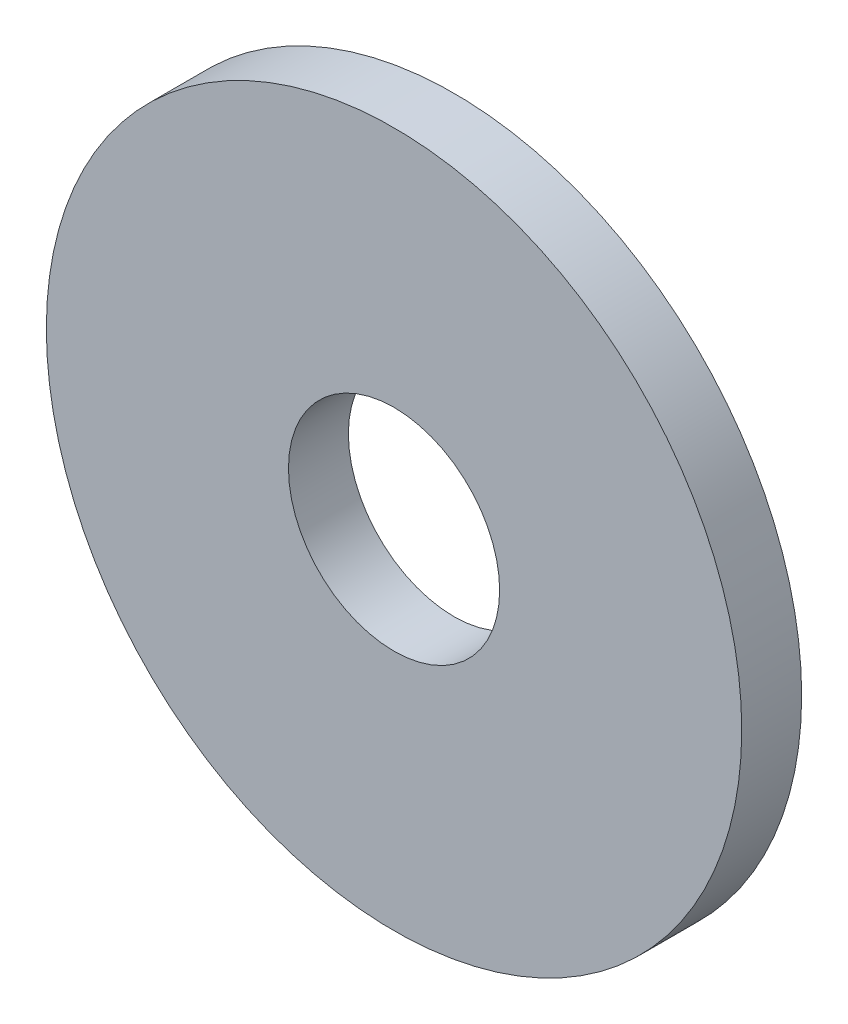
ISO-10303-21;
HEADER;
FILE_DESCRIPTION(('STEP AP214'),'2;1');
FILE_NAME('part.step','',(''),(''),'','','');
FILE_SCHEMA(('AUTOMOTIVE_DESIGN { 1 0 10303 214 1 1 1 1 }'));
ENDSEC;
DATA;
#1=APPLICATION_CONTEXT('core data for automotive mechanical design processes');
#2=APPLICATION_PROTOCOL_DEFINITION('international standard','automotive_design',2000,#1);
#3=PRODUCT_CONTEXT('',#1,'mechanical');
#4=PRODUCT('Part','Part','',(#3));
#5=PRODUCT_RELATED_PRODUCT_CATEGORY('part','',(#4));
#6=PRODUCT_DEFINITION_FORMATION('','',#4);
#7=PRODUCT_DEFINITION_CONTEXT('part definition',#1,'design');
#8=PRODUCT_DEFINITION('design','',#6,#7);
#9=PRODUCT_DEFINITION_SHAPE('','',#8);
#10=(LENGTH_UNIT() NAMED_UNIT(*) SI_UNIT(.MILLI.,.METRE.));
#11=(NAMED_UNIT(*) PLANE_ANGLE_UNIT() SI_UNIT($,.RADIAN.));
#12=(NAMED_UNIT(*) SI_UNIT($,.STERADIAN.) SOLID_ANGLE_UNIT());
#13=UNCERTAINTY_MEASURE_WITH_UNIT(LENGTH_MEASURE(1.E-05),#10,'distance_accuracy_value','');
#14=(GEOMETRIC_REPRESENTATION_CONTEXT(3) GLOBAL_UNCERTAINTY_ASSIGNED_CONTEXT((#13)) GLOBAL_UNIT_ASSIGNED_CONTEXT((#10,
#11,#12)) REPRESENTATION_CONTEXT('',''));
#15=CARTESIAN_POINT('',(0.,0.,0.));
#16=DIRECTION('',(0.,0.,1.));
#17=DIRECTION('',(1.,0.,0.));
#18=AXIS2_PLACEMENT_3D('',#15,#16,#17);
#19=CARTESIAN_POINT('',(0.,0.,0.61));
#20=DIRECTION('',(0.,0.,1.));
#21=DIRECTION('',(1.,0.,0.));
#22=AXIS2_PLACEMENT_3D('',#19,#20,#21);
#23=PLANE('',#22);
#24=CARTESIAN_POINT('',(0.,0.,0.61));
#25=DIRECTION('',(0.,0.,1.));
#26=DIRECTION('',(1.,0.,0.));
#27=AXIS2_PLACEMENT_3D('',#24,#25,#26);
#28=CIRCLE('',#27,7.08);
#29=CARTESIAN_POINT('',(7.08,0.,0.61));
#30=VERTEX_POINT('',#29);
#31=EDGE_CURVE('E10',#30,#30,#28,.T.);
#32=ORIENTED_EDGE('',*,*,#31,.T.);
#33=EDGE_LOOP('',(#32));
#34=FACE_BOUND('',#33,.T.);
#35=CARTESIAN_POINT('',(0.,0.,0.61));
#36=DIRECTION('',(0.,0.,1.));
#37=DIRECTION('',(1.,0.,0.));
#38=AXIS2_PLACEMENT_3D('',#35,#36,#37);
#39=CIRCLE('',#38,2.15);
#40=CARTESIAN_POINT('',(2.15,0.,0.61));
#41=VERTEX_POINT('',#40);
#42=EDGE_CURVE('E50',#41,#41,#39,.T.);
#43=ORIENTED_EDGE('',*,*,#42,.F.);
#44=EDGE_LOOP('',(#43));
#45=FACE_BOUND('',#44,.T.);
#46=ADVANCED_FACE('F37',(#34,#45),#23,.T.);
#47=CARTESIAN_POINT('',(0.,0.,-0.61));
#48=DIRECTION('',(0.,0.,1.));
#49=DIRECTION('',(1.,0.,0.));
#50=AXIS2_PLACEMENT_3D('',#47,#48,#49);
#51=PLANE('',#50);
#52=CARTESIAN_POINT('',(0.,0.,-0.61));
#53=DIRECTION('',(0.,0.,1.));
#54=DIRECTION('',(1.,0.,0.));
#55=AXIS2_PLACEMENT_3D('',#52,#53,#54);
#56=CIRCLE('',#55,7.08);
#57=CARTESIAN_POINT('',(7.08,0.,-0.61));
#58=VERTEX_POINT('',#57);
#59=EDGE_CURVE('E41',#58,#58,#56,.T.);
#60=ORIENTED_EDGE('',*,*,#59,.F.);
#61=EDGE_LOOP('',(#60));
#62=FACE_BOUND('',#61,.T.);
#63=CARTESIAN_POINT('',(0.,0.,-0.61));
#64=DIRECTION('',(0.,0.,1.));
#65=DIRECTION('',(1.,0.,0.));
#66=AXIS2_PLACEMENT_3D('',#63,#64,#65);
#67=CIRCLE('',#66,2.15);
#68=CARTESIAN_POINT('',(2.15,0.,-0.61));
#69=VERTEX_POINT('',#68);
#70=EDGE_CURVE('E52',#69,#69,#67,.T.);
#71=ORIENTED_EDGE('',*,*,#70,.T.);
#72=EDGE_LOOP('',(#71));
#73=FACE_BOUND('',#72,.T.);
#74=ADVANCED_FACE('F64',(#62,#73),#51,.F.);
#75=CARTESIAN_POINT('',(0.,0.,0.61));
#76=DIRECTION('',(0.,0.,-1.));
#77=DIRECTION('',(-1.,0.,0.));
#78=AXIS2_PLACEMENT_3D('',#75,#76,#77);
#79=CYLINDRICAL_SURFACE('',#78,7.08);
#80=ORIENTED_EDGE('',*,*,#31,.F.);
#81=EDGE_LOOP('',(#80));
#82=FACE_BOUND('',#81,.T.);
#83=ORIENTED_EDGE('',*,*,#59,.T.);
#84=EDGE_LOOP('',(#83));
#85=FACE_BOUND('',#84,.T.);
#86=ADVANCED_FACE('F39',(#82,#85),#79,.T.);
#87=CARTESIAN_POINT('',(0.,0.,0.61));
#88=DIRECTION('',(0.,0.,-1.));
#89=DIRECTION('',(-1.,0.,0.));
#90=AXIS2_PLACEMENT_3D('',#87,#88,#89);
#91=CYLINDRICAL_SURFACE('',#90,2.15);
#92=ORIENTED_EDGE('',*,*,#42,.T.);
#93=EDGE_LOOP('',(#92));
#94=FACE_BOUND('',#93,.T.);
#95=ORIENTED_EDGE('',*,*,#70,.F.);
#96=EDGE_LOOP('',(#95));
#97=FACE_BOUND('',#96,.T.);
#98=ADVANCED_FACE('F60',(#94,#97),#91,.F.);
#99=CLOSED_SHELL('',(#46,#74,#86,#98));
#100=MANIFOLD_SOLID_BREP('B2',#99);
#101=ADVANCED_BREP_SHAPE_REPRESENTATION('',(#18,#100),#14);
#102=SHAPE_DEFINITION_REPRESENTATION(#9,#101);
ENDSEC;
END-ISO-10303-21;
